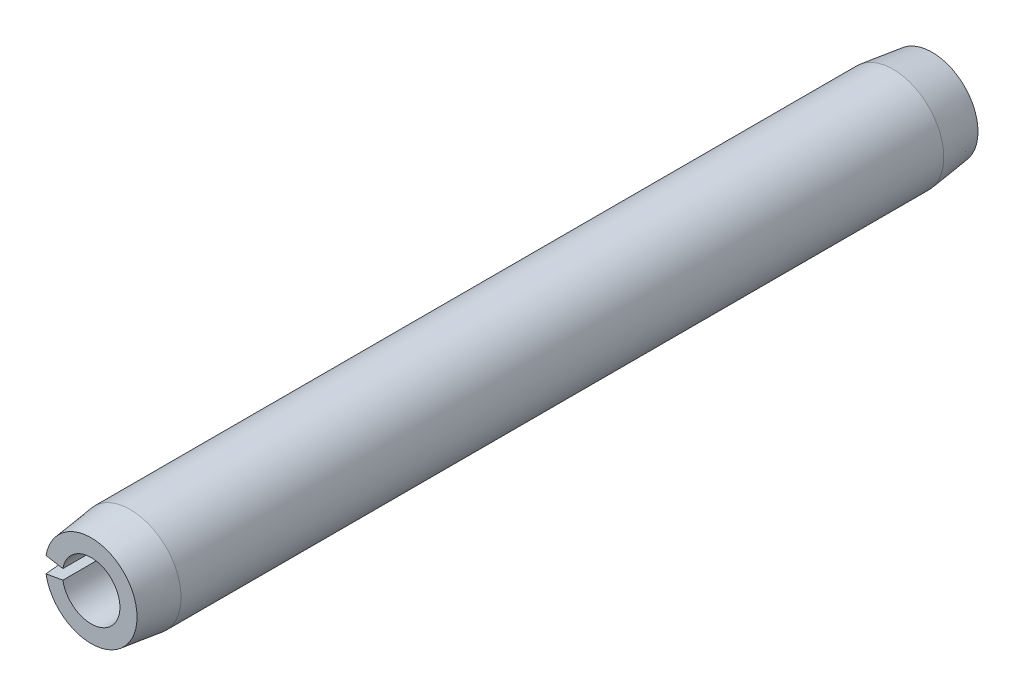
ISO-10303-21;
HEADER;
FILE_DESCRIPTION(('STEP AP214'),'2;1');
FILE_NAME('part.step','',(''),(''),'','','');
FILE_SCHEMA(('AUTOMOTIVE_DESIGN { 1 0 10303 214 1 1 1 1 }'));
ENDSEC;
DATA;
#1=APPLICATION_CONTEXT('core data for automotive mechanical design processes');
#2=APPLICATION_PROTOCOL_DEFINITION('international standard','automotive_design',2000,#1);
#3=PRODUCT_CONTEXT('',#1,'mechanical');
#4=PRODUCT('Part','Part','',(#3));
#5=PRODUCT_RELATED_PRODUCT_CATEGORY('part','',(#4));
#6=PRODUCT_DEFINITION_FORMATION('','',#4);
#7=PRODUCT_DEFINITION_CONTEXT('part definition',#1,'design');
#8=PRODUCT_DEFINITION('design','',#6,#7);
#9=PRODUCT_DEFINITION_SHAPE('','',#8);
#10=(LENGTH_UNIT() NAMED_UNIT(*) SI_UNIT(.MILLI.,.METRE.));
#11=(NAMED_UNIT(*) PLANE_ANGLE_UNIT() SI_UNIT($,.RADIAN.));
#12=(NAMED_UNIT(*) SI_UNIT($,.STERADIAN.) SOLID_ANGLE_UNIT());
#13=UNCERTAINTY_MEASURE_WITH_UNIT(LENGTH_MEASURE(1.E-05),#10,'distance_accuracy_value','');
#14=(GEOMETRIC_REPRESENTATION_CONTEXT(3) GLOBAL_UNCERTAINTY_ASSIGNED_CONTEXT((#13)) GLOBAL_UNIT_ASSIGNED_CONTEXT((#10,
#11,#12)) REPRESENTATION_CONTEXT('',''));
#15=CARTESIAN_POINT('',(0.,0.,0.));
#16=DIRECTION('',(0.,0.,1.));
#17=DIRECTION('',(1.,0.,0.));
#18=AXIS2_PLACEMENT_3D('',#15,#16,#17);
#19=CARTESIAN_POINT('',(0.,0.,8.73125));
#20=DIRECTION('',(0.,0.,-1.));
#21=DIRECTION('',(-1.,0.,0.));
#22=AXIS2_PLACEMENT_3D('',#19,#20,#21);
#23=CYLINDRICAL_SURFACE('',#22,0.5969);
#24=CARTESIAN_POINT('',(0.,0.,-8.73125));
#25=DIRECTION('',(0.,0.,-1.));
#26=DIRECTION('',(1.,0.,0.));
#27=AXIS2_PLACEMENT_3D('',#24,#25,#26);
#28=CIRCLE('',#27,0.5969);
#29=CARTESIAN_POINT('',(-0.587831747772987,0.103650597249389,-8.73125));
#30=VERTEX_POINT('',#29);
#31=CARTESIAN_POINT('',(-0.587831747772987,-0.103650597249389,-8.73125));
#32=VERTEX_POINT('',#31);
#33=EDGE_CURVE('E115',#30,#32,#28,.T.);
#34=ORIENTED_EDGE('',*,*,#33,.T.);
#35=DIRECTION('',(0.,0.,-1.));
#36=VECTOR('',#35,1.);
#37=CARTESIAN_POINT('',(-0.587831747772987,-0.103650597249389,8.73125));
#38=LINE('',#37,#36);
#39=CARTESIAN_POINT('',(-0.587831747772987,-0.103650597249389,8.73125));
#40=VERTEX_POINT('',#39);
#41=EDGE_CURVE('E11',#40,#32,#38,.T.);
#42=ORIENTED_EDGE('',*,*,#41,.F.);
#43=CARTESIAN_POINT('',(0.,0.,8.73125));
#44=DIRECTION('',(0.,0.,-1.));
#45=DIRECTION('',(1.,0.,0.));
#46=AXIS2_PLACEMENT_3D('',#43,#44,#45);
#47=CIRCLE('',#46,0.5969);
#48=CARTESIAN_POINT('',(-0.587831747772987,0.103650597249389,8.73125));
#49=VERTEX_POINT('',#48);
#50=EDGE_CURVE('E111',#49,#40,#47,.T.);
#51=ORIENTED_EDGE('',*,*,#50,.F.);
#52=DIRECTION('',(0.,0.,-1.));
#53=VECTOR('',#52,1.);
#54=CARTESIAN_POINT('',(-0.587831747772987,0.103650597249389,8.73125));
#55=LINE('',#54,#53);
#56=EDGE_CURVE('E104',#49,#30,#55,.T.);
#57=ORIENTED_EDGE('',*,*,#56,.T.);
#58=EDGE_LOOP('',(#34,#42,#51,#57));
#59=FACE_BOUND('',#58,.T.);
#60=ADVANCED_FACE('F32',(#59),#23,.F.);
#61=CARTESIAN_POINT('',(-0.587831747772987,-0.103650597249389,8.73125));
#62=DIRECTION('',(0.173648177666926,-0.984807753012209,0.));
#63=DIRECTION('',(0.984807753012209,0.173648177666926,0.));
#64=AXIS2_PLACEMENT_3D('',#61,#62,#63);
#65=PLANE('',#64);
#66=DIRECTION('',(0.,0.,-1.));
#67=VECTOR('',#66,1.);
#68=CARTESIAN_POINT('',(-1.03808585245017,-0.183042544078708,8.73125));
#69=LINE('',#68,#67);
#70=CARTESIAN_POINT('',(-1.03808585245017,-0.183042544078708,7.91845));
#71=VERTEX_POINT('',#70);
#72=CARTESIAN_POINT('',(-1.03808585245017,-0.183042544078708,-7.91845));
#73=VERTEX_POINT('',#72);
#74=EDGE_CURVE('E39',#71,#73,#69,.T.);
#75=ORIENTED_EDGE('',*,*,#74,.F.);
#76=DIRECTION('',(-0.122150368266263,-0.0215384056288167,-0.992277876713668));
#77=VECTOR('',#76,1.);
#78=CARTESIAN_POINT('',(0.,0.,16.3512500000001));
#79=LINE('',#78,#77);
#80=CARTESIAN_POINT('',(-0.938029384744131,-0.165399889227749,8.73125));
#81=VERTEX_POINT('',#80);
#82=EDGE_CURVE('E86',#71,#81,#79,.F.);
#83=ORIENTED_EDGE('',*,*,#82,.T.);
#84=DIRECTION('',(-0.984807753012209,-0.173648177666926,0.));
#85=VECTOR('',#84,1.);
#86=CARTESIAN_POINT('',(-0.587831747772987,-0.103650597249389,8.73125));
#87=LINE('',#86,#85);
#88=EDGE_CURVE('E119',#40,#81,#87,.T.);
#89=ORIENTED_EDGE('',*,*,#88,.F.);
#90=ORIENTED_EDGE('',*,*,#41,.T.);
#91=DIRECTION('',(-0.984807753012209,-0.173648177666926,0.));
#92=VECTOR('',#91,1.);
#93=CARTESIAN_POINT('',(-0.587831747772987,-0.103650597249389,-8.73125));
#94=LINE('',#93,#92);
#95=CARTESIAN_POINT('',(-0.938029384744131,-0.165399889227749,-8.73125));
#96=VERTEX_POINT('',#95);
#97=EDGE_CURVE('E112',#32,#96,#94,.T.);
#98=ORIENTED_EDGE('',*,*,#97,.T.);
#99=DIRECTION('',(0.122150368266263,0.0215384056288167,-0.992277876713668));
#100=VECTOR('',#99,1.);
#101=CARTESIAN_POINT('',(0.,0.,-16.3512500000001));
#102=LINE('',#101,#100);
#103=EDGE_CURVE('E54',#96,#73,#102,.F.);
#104=ORIENTED_EDGE('',*,*,#103,.T.);
#105=EDGE_LOOP('',(#75,#83,#89,#90,#98,#104));
#106=FACE_BOUND('',#105,.T.);
#107=ADVANCED_FACE('F133',(#106),#65,.F.);
#108=CARTESIAN_POINT('',(0.,0.,8.73125));
#109=DIRECTION('',(0.,0.,-1.));
#110=DIRECTION('',(-1.,0.,0.));
#111=AXIS2_PLACEMENT_3D('',#108,#109,#110);
#112=CYLINDRICAL_SURFACE('',#111,1.0541);
#113=DIRECTION('',(0.,0.,-1.));
#114=VECTOR('',#113,1.);
#115=CARTESIAN_POINT('',(-1.03808585245017,0.183042544078708,8.73125));
#116=LINE('',#115,#114);
#117=CARTESIAN_POINT('',(-1.03808585245017,0.183042544078708,7.91845));
#118=VERTEX_POINT('',#117);
#119=CARTESIAN_POINT('',(-1.03808585245017,0.183042544078708,-7.91845));
#120=VERTEX_POINT('',#119);
#121=EDGE_CURVE('E96',#118,#120,#116,.T.);
#122=ORIENTED_EDGE('',*,*,#121,.F.);
#123=CARTESIAN_POINT('',(0.,0.,7.91845));
#124=DIRECTION('',(0.,0.,-1.));
#125=DIRECTION('',(-1.,0.,0.));
#126=AXIS2_PLACEMENT_3D('',#123,#124,#125);
#127=CIRCLE('',#126,1.0541);
#128=EDGE_CURVE('E83',#118,#71,#127,.T.);
#129=ORIENTED_EDGE('',*,*,#128,.T.);
#130=ORIENTED_EDGE('',*,*,#74,.T.);
#131=CARTESIAN_POINT('',(0.,0.,-7.91845));
#132=DIRECTION('',(0.,0.,-1.));
#133=DIRECTION('',(-1.,0.,0.));
#134=AXIS2_PLACEMENT_3D('',#131,#132,#133);
#135=CIRCLE('',#134,1.0541);
#136=EDGE_CURVE('E103',#120,#73,#135,.T.);
#137=ORIENTED_EDGE('',*,*,#136,.F.);
#138=EDGE_LOOP('',(#122,#129,#130,#137));
#139=FACE_BOUND('',#138,.T.);
#140=ADVANCED_FACE('F102',(#139),#112,.T.);
#141=CARTESIAN_POINT('',(-1.03808585245017,0.183042544078708,8.73125));
#142=DIRECTION('',(0.173648177666926,0.984807753012209,0.));
#143=DIRECTION('',(-0.984807753012209,0.173648177666926,0.));
#144=AXIS2_PLACEMENT_3D('',#141,#142,#143);
#145=PLANE('',#144);
#146=DIRECTION('',(0.984807753012209,-0.173648177666926,0.));
#147=VECTOR('',#146,1.);
#148=CARTESIAN_POINT('',(-1.03808585245017,0.183042544078708,8.73125));
#149=LINE('',#148,#147);
#150=CARTESIAN_POINT('',(-0.93802938474413,0.165399889227749,8.73125));
#151=VERTEX_POINT('',#150);
#152=EDGE_CURVE('E99',#151,#49,#149,.T.);
#153=ORIENTED_EDGE('',*,*,#152,.F.);
#154=DIRECTION('',(0.122150368266263,-0.0215384056288167,0.992277876713668));
#155=VECTOR('',#154,1.);
#156=CARTESIAN_POINT('',(0.,0.,16.3512500000001));
#157=LINE('',#156,#155);
#158=EDGE_CURVE('E46',#151,#118,#157,.F.);
#159=ORIENTED_EDGE('',*,*,#158,.T.);
#160=ORIENTED_EDGE('',*,*,#121,.T.);
#161=DIRECTION('',(-0.122150368266263,0.0215384056288167,0.992277876713668));
#162=VECTOR('',#161,1.);
#163=CARTESIAN_POINT('',(0.,0.,-16.3512500000001));
#164=LINE('',#163,#162);
#165=CARTESIAN_POINT('',(-0.93802938474413,0.165399889227749,-8.73125));
#166=VERTEX_POINT('',#165);
#167=EDGE_CURVE('E125',#120,#166,#164,.F.);
#168=ORIENTED_EDGE('',*,*,#167,.T.);
#169=DIRECTION('',(0.984807753012209,-0.173648177666926,0.));
#170=VECTOR('',#169,1.);
#171=CARTESIAN_POINT('',(-1.03808585245017,0.183042544078708,-8.73125));
#172=LINE('',#171,#170);
#173=EDGE_CURVE('E109',#166,#30,#172,.T.);
#174=ORIENTED_EDGE('',*,*,#173,.T.);
#175=ORIENTED_EDGE('',*,*,#56,.F.);
#176=EDGE_LOOP('',(#153,#159,#160,#168,#174,#175));
#177=FACE_BOUND('',#176,.T.);
#178=ADVANCED_FACE('F94',(#177),#145,.F.);
#179=CARTESIAN_POINT('',(0.,0.,8.73125));
#180=DIRECTION('',(0.,0.,1.));
#181=DIRECTION('',(1.,0.,0.));
#182=AXIS2_PLACEMENT_3D('',#179,#180,#181);
#183=PLANE('',#182);
#184=CARTESIAN_POINT('',(0.,0.,8.73125));
#185=DIRECTION('',(0.,0.,-1.));
#186=DIRECTION('',(-1.,0.,0.));
#187=AXIS2_PLACEMENT_3D('',#184,#185,#186);
#188=CIRCLE('',#187,0.952500000000002);
#189=EDGE_CURVE('E90',#151,#81,#188,.T.);
#190=ORIENTED_EDGE('',*,*,#189,.F.);
#191=ORIENTED_EDGE('',*,*,#152,.T.);
#192=ORIENTED_EDGE('',*,*,#50,.T.);
#193=ORIENTED_EDGE('',*,*,#88,.T.);
#194=EDGE_LOOP('',(#190,#191,#192,#193));
#195=FACE_BOUND('',#194,.T.);
#196=ADVANCED_FACE('F134',(#195),#183,.T.);
#197=CARTESIAN_POINT('',(0.,0.,-8.73125));
#198=DIRECTION('',(0.,0.,1.));
#199=DIRECTION('',(1.,0.,0.));
#200=AXIS2_PLACEMENT_3D('',#197,#198,#199);
#201=PLANE('',#200);
#202=ORIENTED_EDGE('',*,*,#173,.F.);
#203=CARTESIAN_POINT('',(0.,0.,-8.73125));
#204=DIRECTION('',(0.,0.,-1.));
#205=DIRECTION('',(-1.,0.,0.));
#206=AXIS2_PLACEMENT_3D('',#203,#204,#205);
#207=CIRCLE('',#206,0.952500000000002);
#208=EDGE_CURVE('E127',#166,#96,#207,.T.);
#209=ORIENTED_EDGE('',*,*,#208,.T.);
#210=ORIENTED_EDGE('',*,*,#97,.F.);
#211=ORIENTED_EDGE('',*,*,#33,.F.);
#212=EDGE_LOOP('',(#202,#209,#210,#211));
#213=FACE_BOUND('',#212,.T.);
#214=ADVANCED_FACE('F141',(#213),#201,.F.);
#215=CARTESIAN_POINT('',(0.,0.,-7.91845));
#216=DIRECTION('',(0.,0.,1.));
#217=DIRECTION('',(1.,0.,0.));
#218=AXIS2_PLACEMENT_3D('',#215,#216,#217);
#219=CONICAL_SURFACE('',#218,1.0541,0.12435499454676);
#220=ORIENTED_EDGE('',*,*,#208,.F.);
#221=ORIENTED_EDGE('',*,*,#167,.F.);
#222=ORIENTED_EDGE('',*,*,#136,.T.);
#223=ORIENTED_EDGE('',*,*,#103,.F.);
#224=EDGE_LOOP('',(#220,#221,#222,#223));
#225=FACE_BOUND('',#224,.T.);
#226=ADVANCED_FACE('F142',(#225),#219,.T.);
#227=CARTESIAN_POINT('',(0.,0.,8.73125));
#228=DIRECTION('',(0.,0.,-1.));
#229=DIRECTION('',(-1.,0.,0.));
#230=AXIS2_PLACEMENT_3D('',#227,#228,#229);
#231=CONICAL_SURFACE('',#230,0.952500000000002,0.12435499454676);
#232=ORIENTED_EDGE('',*,*,#128,.F.);
#233=ORIENTED_EDGE('',*,*,#158,.F.);
#234=ORIENTED_EDGE('',*,*,#189,.T.);
#235=ORIENTED_EDGE('',*,*,#82,.F.);
#236=EDGE_LOOP('',(#232,#233,#234,#235));
#237=FACE_BOUND('',#236,.T.);
#238=ADVANCED_FACE('F84',(#237),#231,.T.);
#239=CLOSED_SHELL('',(#60,#107,#140,#178,#196,#214,#226,#238));
#240=MANIFOLD_SOLID_BREP('B2',#239);
#241=ADVANCED_BREP_SHAPE_REPRESENTATION('',(#18,#240),#14);
#242=SHAPE_DEFINITION_REPRESENTATION(#9,#241);
ENDSEC;
END-ISO-10303-21;
